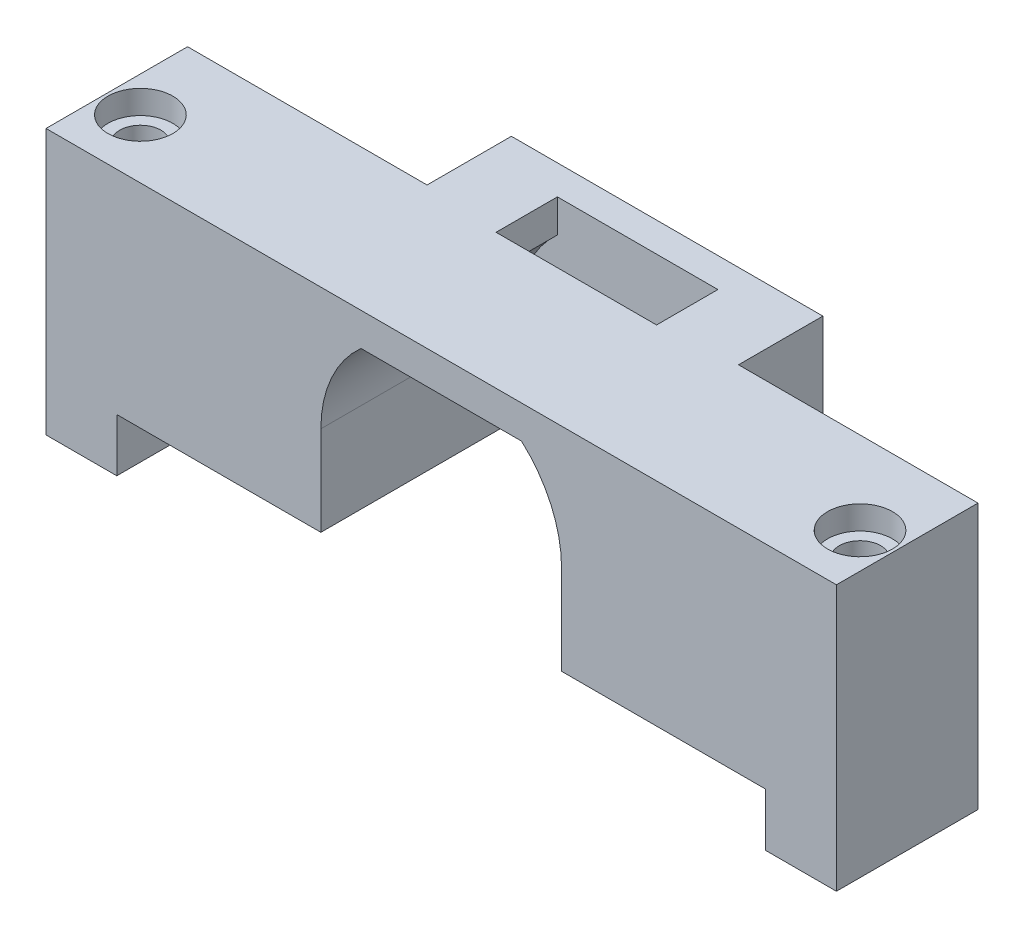
ISO-10303-21;
HEADER;
FILE_DESCRIPTION(('STEP AP214'),'2;1');
FILE_NAME('part.step','',(''),(''),'','','');
FILE_SCHEMA(('AUTOMOTIVE_DESIGN { 1 0 10303 214 1 1 1 1 }'));
ENDSEC;
DATA;
#1=APPLICATION_CONTEXT('core data for automotive mechanical design processes');
#2=APPLICATION_PROTOCOL_DEFINITION('international standard','automotive_design',2000,#1);
#3=PRODUCT_CONTEXT('',#1,'mechanical');
#4=PRODUCT('Part','Part','',(#3));
#5=PRODUCT_RELATED_PRODUCT_CATEGORY('part','',(#4));
#6=PRODUCT_DEFINITION_FORMATION('','',#4);
#7=PRODUCT_DEFINITION_CONTEXT('part definition',#1,'design');
#8=PRODUCT_DEFINITION('design','',#6,#7);
#9=PRODUCT_DEFINITION_SHAPE('','',#8);
#10=(LENGTH_UNIT() NAMED_UNIT(*) SI_UNIT(.MILLI.,.METRE.));
#11=(NAMED_UNIT(*) PLANE_ANGLE_UNIT() SI_UNIT($,.RADIAN.));
#12=(NAMED_UNIT(*) SI_UNIT($,.STERADIAN.) SOLID_ANGLE_UNIT());
#13=UNCERTAINTY_MEASURE_WITH_UNIT(LENGTH_MEASURE(1.E-05),#10,'distance_accuracy_value','');
#14=(GEOMETRIC_REPRESENTATION_CONTEXT(3) GLOBAL_UNCERTAINTY_ASSIGNED_CONTEXT((#13)) GLOBAL_UNIT_ASSIGNED_CONTEXT((#10,
#11,#12)) REPRESENTATION_CONTEXT('',''));
#15=CARTESIAN_POINT('',(0.,0.,0.));
#16=DIRECTION('',(0.,0.,1.));
#17=DIRECTION('',(1.,0.,0.));
#18=AXIS2_PLACEMENT_3D('',#15,#16,#17);
#19=CARTESIAN_POINT('',(0.,18.,12.));
#20=DIRECTION('',(0.,1.,0.));
#21=DIRECTION('',(0.,0.,1.));
#22=AXIS2_PLACEMENT_3D('',#19,#20,#21);
#23=PLANE('',#22);
#24=CARTESIAN_POINT('',(-3.,18.,7.));
#25=DIRECTION('',(0.,1.,0.));
#26=DIRECTION('',(0.,0.,1.));
#27=AXIS2_PLACEMENT_3D('',#24,#25,#26);
#28=CIRCLE('',#27,2.75);
#29=CARTESIAN_POINT('',(-3.,18.,9.75));
#30=VERTEX_POINT('',#29);
#31=EDGE_CURVE('E293',#30,#30,#28,.T.);
#32=ORIENTED_EDGE('',*,*,#31,.F.);
#33=EDGE_LOOP('',(#32));
#34=FACE_BOUND('',#33,.T.);
#35=CARTESIAN_POINT('',(58.,18.,6.99999999999999));
#36=DIRECTION('',(0.,1.,0.));
#37=DIRECTION('',(0.,0.,1.));
#38=AXIS2_PLACEMENT_3D('',#35,#36,#37);
#39=CIRCLE('',#38,2.75);
#40=CARTESIAN_POINT('',(58.,18.,9.74999999999999));
#41=VERTEX_POINT('',#40);
#42=EDGE_CURVE('E287',#41,#41,#39,.T.);
#43=ORIENTED_EDGE('',*,*,#42,.F.);
#44=EDGE_LOOP('',(#43));
#45=FACE_BOUND('',#44,.T.);
#46=DIRECTION('',(1.,0.,0.));
#47=VECTOR('',#46,1.);
#48=CARTESIAN_POINT('',(0.,18.,0.));
#49=LINE('',#48,#47);
#50=CARTESIAN_POINT('',(-6.,18.,0.));
#51=VERTEX_POINT('',#50);
#52=CARTESIAN_POINT('',(14.3,18.,0.));
#53=VERTEX_POINT('',#52);
#54=EDGE_CURVE('E479',#51,#53,#49,.T.);
#55=ORIENTED_EDGE('',*,*,#54,.F.);
#56=DIRECTION('',(0.,0.,-1.));
#57=VECTOR('',#56,1.);
#58=CARTESIAN_POINT('',(-6.,18.,0.));
#59=LINE('',#58,#57);
#60=CARTESIAN_POINT('',(-6.,18.,12.));
#61=VERTEX_POINT('',#60);
#62=EDGE_CURVE('E427',#61,#51,#59,.T.);
#63=ORIENTED_EDGE('',*,*,#62,.F.);
#64=DIRECTION('',(1.,0.,0.));
#65=VECTOR('',#64,1.);
#66=CARTESIAN_POINT('',(0.,18.,12.));
#67=LINE('',#66,#65);
#68=CARTESIAN_POINT('',(61.,18.,12.));
#69=VERTEX_POINT('',#68);
#70=EDGE_CURVE('E466',#61,#69,#67,.T.);
#71=ORIENTED_EDGE('',*,*,#70,.T.);
#72=DIRECTION('',(0.,0.,1.));
#73=VECTOR('',#72,1.);
#74=CARTESIAN_POINT('',(61.,18.,12.));
#75=LINE('',#74,#73);
#76=CARTESIAN_POINT('',(61.,18.,0.));
#77=VERTEX_POINT('',#76);
#78=EDGE_CURVE('E394',#77,#69,#75,.T.);
#79=ORIENTED_EDGE('',*,*,#78,.F.);
#80=CARTESIAN_POINT('',(40.7,18.,0.));
#81=VERTEX_POINT('',#80);
#82=EDGE_CURVE('E478',#81,#77,#49,.T.);
#83=ORIENTED_EDGE('',*,*,#82,.F.);
#84=DIRECTION('',(0.,0.,1.));
#85=VECTOR('',#84,1.);
#86=CARTESIAN_POINT('',(40.7,18.,-4.65));
#87=LINE('',#86,#85);
#88=CARTESIAN_POINT('',(40.7,18.,-7.15));
#89=VERTEX_POINT('',#88);
#90=EDGE_CURVE('E365',#89,#81,#87,.T.);
#91=ORIENTED_EDGE('',*,*,#90,.F.);
#92=DIRECTION('',(1.,0.,0.));
#93=VECTOR('',#92,1.);
#94=CARTESIAN_POINT('',(14.3,18.,-7.15));
#95=LINE('',#94,#93);
#96=CARTESIAN_POINT('',(14.3,18.,-7.15));
#97=VERTEX_POINT('',#96);
#98=EDGE_CURVE('E314',#97,#89,#95,.T.);
#99=ORIENTED_EDGE('',*,*,#98,.F.);
#100=DIRECTION('',(0.,0.,1.));
#101=VECTOR('',#100,1.);
#102=CARTESIAN_POINT('',(14.3,18.,-4.65));
#103=LINE('',#102,#101);
#104=EDGE_CURVE('E369',#97,#53,#103,.T.);
#105=ORIENTED_EDGE('',*,*,#104,.T.);
#106=EDGE_LOOP('',(#55,#63,#71,#79,#83,#91,#99,#105));
#107=FACE_BOUND('',#106,.T.);
#108=DIRECTION('',(0.,0.,-1.));
#109=VECTOR('',#108,1.);
#110=CARTESIAN_POINT('',(20.697059459322,18.,0.549999999999999));
#111=LINE('',#110,#109);
#112=CARTESIAN_POINT('',(20.697059459322,18.,0.549999999999999));
#113=VERTEX_POINT('',#112);
#114=CARTESIAN_POINT('',(20.697059459322,18.,-4.65));
#115=VERTEX_POINT('',#114);
#116=EDGE_CURVE('E219',#113,#115,#111,.T.);
#117=ORIENTED_EDGE('',*,*,#116,.T.);
#118=DIRECTION('',(-1.,0.,0.));
#119=VECTOR('',#118,1.);
#120=CARTESIAN_POINT('',(34.302940540678,18.,-4.65));
#121=LINE('',#120,#119);
#122=CARTESIAN_POINT('',(34.302940540678,18.,-4.65));
#123=VERTEX_POINT('',#122);
#124=EDGE_CURVE('E228',#123,#115,#121,.T.);
#125=ORIENTED_EDGE('',*,*,#124,.F.);
#126=DIRECTION('',(0.,0.,-1.));
#127=VECTOR('',#126,1.);
#128=CARTESIAN_POINT('',(34.302940540678,18.,0.549999999999999));
#129=LINE('',#128,#127);
#130=CARTESIAN_POINT('',(34.302940540678,18.,0.55));
#131=VERTEX_POINT('',#130);
#132=EDGE_CURVE('E238',#131,#123,#129,.T.);
#133=ORIENTED_EDGE('',*,*,#132,.F.);
#134=DIRECTION('',(-1.,0.,0.));
#135=VECTOR('',#134,1.);
#136=CARTESIAN_POINT('',(34.302940540678,18.,0.549999999999999));
#137=LINE('',#136,#135);
#138=EDGE_CURVE('E57',#131,#113,#137,.T.);
#139=ORIENTED_EDGE('',*,*,#138,.T.);
#140=EDGE_LOOP('',(#117,#125,#133,#139));
#141=FACE_BOUND('',#140,.T.);
#142=ADVANCED_FACE('F41',(#34,#45,#107,#141),#23,.T.);
#143=CARTESIAN_POINT('',(0.,0.,12.));
#144=DIRECTION('',(0.,1.,0.));
#145=DIRECTION('',(0.,0.,1.));
#146=AXIS2_PLACEMENT_3D('',#143,#144,#145);
#147=PLANE('',#146);
#148=DIRECTION('',(-1.,0.,0.));
#149=VECTOR('',#148,1.);
#150=CARTESIAN_POINT('',(40.7,0.,-7.15));
#151=LINE('',#150,#149);
#152=CARTESIAN_POINT('',(22.5946434398761,0.,-7.15));
#153=VERTEX_POINT('',#152);
#154=CARTESIAN_POINT('',(14.3,0.,-7.15));
#155=VERTEX_POINT('',#154);
#156=EDGE_CURVE('E323',#153,#155,#151,.T.);
#157=ORIENTED_EDGE('',*,*,#156,.F.);
#158=DIRECTION('',(0.,0.,-1.));
#159=VECTOR('',#158,1.);
#160=CARTESIAN_POINT('',(22.5946434398761,0.,7.47494488658952));
#161=LINE('',#160,#159);
#162=CARTESIAN_POINT('',(22.5946434398761,0.,-4.65));
#163=VERTEX_POINT('',#162);
#164=EDGE_CURVE('E260',#163,#153,#161,.T.);
#165=ORIENTED_EDGE('',*,*,#164,.F.);
#166=DIRECTION('',(-1.,0.,0.));
#167=VECTOR('',#166,1.);
#168=CARTESIAN_POINT('',(40.7,0.,-4.65));
#169=LINE('',#168,#167);
#170=CARTESIAN_POINT('',(17.3,0.,-4.65));
#171=VERTEX_POINT('',#170);
#172=EDGE_CURVE('E308',#163,#171,#169,.T.);
#173=ORIENTED_EDGE('',*,*,#172,.T.);
#174=DIRECTION('',(0.,0.,-1.));
#175=VECTOR('',#174,1.);
#176=CARTESIAN_POINT('',(17.3,0.,12.));
#177=LINE('',#176,#175);
#178=CARTESIAN_POINT('',(17.3,0.,12.));
#179=VERTEX_POINT('',#178);
#180=EDGE_CURVE('E487',#179,#171,#177,.T.);
#181=ORIENTED_EDGE('',*,*,#180,.F.);
#182=DIRECTION('',(1.,0.,0.));
#183=VECTOR('',#182,1.);
#184=CARTESIAN_POINT('',(0.,0.,12.));
#185=LINE('',#184,#183);
#186=CARTESIAN_POINT('',(0.,0.,12.));
#187=VERTEX_POINT('',#186);
#188=EDGE_CURVE('E469',#187,#179,#185,.T.);
#189=ORIENTED_EDGE('',*,*,#188,.F.);
#190=DIRECTION('',(0.,0.,-1.));
#191=VECTOR('',#190,1.);
#192=CARTESIAN_POINT('',(0.,0.,12.));
#193=LINE('',#192,#191);
#194=CARTESIAN_POINT('',(0.,0.,0.));
#195=VERTEX_POINT('',#194);
#196=EDGE_CURVE('E491',#187,#195,#193,.T.);
#197=ORIENTED_EDGE('',*,*,#196,.T.);
#198=DIRECTION('',(1.,0.,0.));
#199=VECTOR('',#198,1.);
#200=CARTESIAN_POINT('',(0.,0.,0.));
#201=LINE('',#200,#199);
#202=CARTESIAN_POINT('',(14.3,0.,0.));
#203=VERTEX_POINT('',#202);
#204=EDGE_CURVE('E453',#195,#203,#201,.T.);
#205=ORIENTED_EDGE('',*,*,#204,.T.);
#206=DIRECTION('',(0.,0.,1.));
#207=VECTOR('',#206,1.);
#208=CARTESIAN_POINT('',(14.3,0.,-4.65));
#209=LINE('',#208,#207);
#210=EDGE_CURVE('E351',#155,#203,#209,.T.);
#211=ORIENTED_EDGE('',*,*,#210,.F.);
#212=EDGE_LOOP('',(#157,#165,#173,#181,#189,#197,#205,#211));
#213=FACE_BOUND('',#212,.T.);
#214=ADVANCED_FACE('F523',(#213),#147,.F.);
#215=CARTESIAN_POINT('',(58.,-9.44974746830584,6.99999999999999));
#216=DIRECTION('',(0.,1.,0.));
#217=DIRECTION('',(0.,0.,1.));
#218=AXIS2_PLACEMENT_3D('',#215,#216,#217);
#219=CYLINDRICAL_SURFACE('',#218,1.75);
#220=CARTESIAN_POINT('',(58.,-4.5,6.99999999999999));
#221=DIRECTION('',(0.,1.,0.));
#222=DIRECTION('',(0.,0.,1.));
#223=AXIS2_PLACEMENT_3D('',#220,#221,#222);
#224=CIRCLE('',#223,1.75);
#225=CARTESIAN_POINT('',(58.,-4.5,8.75));
#226=VERTEX_POINT('',#225);
#227=EDGE_CURVE('E373',#226,#226,#224,.F.);
#228=ORIENTED_EDGE('',*,*,#227,.T.);
#229=EDGE_LOOP('',(#228));
#230=FACE_BOUND('',#229,.T.);
#231=CARTESIAN_POINT('',(58.,16.,6.99999999999999));
#232=DIRECTION('',(0.,1.,0.));
#233=DIRECTION('',(0.,0.,1.));
#234=AXIS2_PLACEMENT_3D('',#231,#232,#233);
#235=CIRCLE('',#234,1.75);
#236=CARTESIAN_POINT('',(58.,16.,8.75));
#237=VERTEX_POINT('',#236);
#238=EDGE_CURVE('E313',#237,#237,#235,.F.);
#239=ORIENTED_EDGE('',*,*,#238,.F.);
#240=EDGE_LOOP('',(#239));
#241=FACE_BOUND('',#240,.T.);
#242=ADVANCED_FACE('F520',(#230,#241),#219,.F.);
#243=CARTESIAN_POINT('',(-3.,-9.44974746830584,7.));
#244=DIRECTION('',(0.,1.,0.));
#245=DIRECTION('',(0.,0.,1.));
#246=AXIS2_PLACEMENT_3D('',#243,#244,#245);
#247=CYLINDRICAL_SURFACE('',#246,1.75);
#248=CARTESIAN_POINT('',(-3.,-4.5,7.));
#249=DIRECTION('',(0.,1.,0.));
#250=DIRECTION('',(0.,0.,1.));
#251=AXIS2_PLACEMENT_3D('',#248,#249,#250);
#252=CIRCLE('',#251,1.75);
#253=CARTESIAN_POINT('',(-3.,-4.5,8.75));
#254=VERTEX_POINT('',#253);
#255=EDGE_CURVE('E374',#254,#254,#252,.F.);
#256=ORIENTED_EDGE('',*,*,#255,.T.);
#257=EDGE_LOOP('',(#256));
#258=FACE_BOUND('',#257,.T.);
#259=CARTESIAN_POINT('',(-3.,16.,7.));
#260=DIRECTION('',(0.,1.,0.));
#261=DIRECTION('',(0.,0.,1.));
#262=AXIS2_PLACEMENT_3D('',#259,#260,#261);
#263=CIRCLE('',#262,1.75);
#264=CARTESIAN_POINT('',(-3.,16.,8.75));
#265=VERTEX_POINT('',#264);
#266=EDGE_CURVE('E292',#265,#265,#263,.F.);
#267=ORIENTED_EDGE('',*,*,#266,.F.);
#268=EDGE_LOOP('',(#267));
#269=FACE_BOUND('',#268,.T.);
#270=ADVANCED_FACE('F522',(#258,#269),#247,.F.);
#271=CARTESIAN_POINT('',(0.,0.,0.));
#272=DIRECTION('',(0.,0.,1.));
#273=DIRECTION('',(1.,0.,0.));
#274=AXIS2_PLACEMENT_3D('',#271,#272,#273);
#275=PLANE('',#274);
#276=DIRECTION('',(0.,1.,0.));
#277=VECTOR('',#276,1.);
#278=CARTESIAN_POINT('',(14.3,0.,0.));
#279=LINE('',#278,#277);
#280=EDGE_CURVE('E332',#203,#53,#279,.T.);
#281=ORIENTED_EDGE('',*,*,#280,.F.);
#282=ORIENTED_EDGE('',*,*,#204,.F.);
#283=DIRECTION('',(0.,-1.,0.));
#284=VECTOR('',#283,1.);
#285=CARTESIAN_POINT('',(0.,18.,0.));
#286=LINE('',#285,#284);
#287=CARTESIAN_POINT('',(0.,-4.5,0.));
#288=VERTEX_POINT('',#287);
#289=EDGE_CURVE('E414',#195,#288,#286,.T.);
#290=ORIENTED_EDGE('',*,*,#289,.T.);
#291=DIRECTION('',(1.,0.,0.));
#292=VECTOR('',#291,1.);
#293=CARTESIAN_POINT('',(-6.,-4.5,0.));
#294=LINE('',#293,#292);
#295=CARTESIAN_POINT('',(-6.,-4.5,0.));
#296=VERTEX_POINT('',#295);
#297=EDGE_CURVE('E443',#296,#288,#294,.T.);
#298=ORIENTED_EDGE('',*,*,#297,.F.);
#299=DIRECTION('',(0.,-1.,0.));
#300=VECTOR('',#299,1.);
#301=CARTESIAN_POINT('',(-6.,18.,0.));
#302=LINE('',#301,#300);
#303=EDGE_CURVE('E415',#51,#296,#302,.T.);
#304=ORIENTED_EDGE('',*,*,#303,.F.);
#305=ORIENTED_EDGE('',*,*,#54,.T.);
#306=EDGE_LOOP('',(#281,#282,#290,#298,#304,#305));
#307=FACE_BOUND('',#306,.T.);
#308=ADVANCED_FACE('F530',(#307),#275,.F.);
#309=DIRECTION('',(0.,-1.,0.));
#310=VECTOR('',#309,1.);
#311=CARTESIAN_POINT('',(40.7,0.,0.));
#312=LINE('',#311,#310);
#313=CARTESIAN_POINT('',(40.7,0.,0.));
#314=VERTEX_POINT('',#313);
#315=EDGE_CURVE('E341',#81,#314,#312,.T.);
#316=ORIENTED_EDGE('',*,*,#315,.F.);
#317=ORIENTED_EDGE('',*,*,#82,.T.);
#318=DIRECTION('',(0.,1.,0.));
#319=VECTOR('',#318,1.);
#320=CARTESIAN_POINT('',(61.,18.,0.));
#321=LINE('',#320,#319);
#322=CARTESIAN_POINT('',(61.,-4.5,0.));
#323=VERTEX_POINT('',#322);
#324=EDGE_CURVE('E390',#323,#77,#321,.T.);
#325=ORIENTED_EDGE('',*,*,#324,.F.);
#326=DIRECTION('',(-1.,0.,0.));
#327=VECTOR('',#326,1.);
#328=CARTESIAN_POINT('',(61.,-4.5,0.));
#329=LINE('',#328,#327);
#330=CARTESIAN_POINT('',(55.,-4.5,0.));
#331=VERTEX_POINT('',#330);
#332=EDGE_CURVE('E398',#323,#331,#329,.T.);
#333=ORIENTED_EDGE('',*,*,#332,.T.);
#334=DIRECTION('',(0.,1.,0.));
#335=VECTOR('',#334,1.);
#336=CARTESIAN_POINT('',(55.,18.,0.));
#337=LINE('',#336,#335);
#338=CARTESIAN_POINT('',(55.,0.,0.));
#339=VERTEX_POINT('',#338);
#340=EDGE_CURVE('E387',#331,#339,#337,.T.);
#341=ORIENTED_EDGE('',*,*,#340,.T.);
#342=DIRECTION('',(1.,0.,0.));
#343=VECTOR('',#342,1.);
#344=CARTESIAN_POINT('',(0.,0.,0.));
#345=LINE('',#344,#343);
#346=EDGE_CURVE('E447',#314,#339,#345,.T.);
#347=ORIENTED_EDGE('',*,*,#346,.F.);
#348=EDGE_LOOP('',(#316,#317,#325,#333,#341,#347));
#349=FACE_BOUND('',#348,.T.);
#350=ADVANCED_FACE('F559',(#349),#275,.F.);
#351=CARTESIAN_POINT('',(27.5,7.6,12.));
#352=DIRECTION('',(0.,0.,-1.));
#353=DIRECTION('',(-1.,0.,0.));
#354=AXIS2_PLACEMENT_3D('',#351,#352,#353);
#355=CYLINDRICAL_SURFACE('',#354,10.2);
#356=DIRECTION('',(0.,0.,-1.));
#357=VECTOR('',#356,1.);
#358=CARTESIAN_POINT('',(17.3,7.6,12.));
#359=LINE('',#358,#357);
#360=CARTESIAN_POINT('',(17.3,7.6,12.));
#361=VERTEX_POINT('',#360);
#362=CARTESIAN_POINT('',(17.3,7.6,-4.65));
#363=VERTEX_POINT('',#362);
#364=EDGE_CURVE('E475',#361,#363,#359,.T.);
#365=ORIENTED_EDGE('',*,*,#364,.T.);
#366=CARTESIAN_POINT('',(27.5,7.6,-4.65));
#367=DIRECTION('',(0.,0.,1.));
#368=DIRECTION('',(1.,0.,0.));
#369=AXIS2_PLACEMENT_3D('',#366,#367,#368);
#370=CIRCLE('',#369,10.2);
#371=CARTESIAN_POINT('',(20.697059459322,15.2,-4.65));
#372=VERTEX_POINT('',#371);
#373=EDGE_CURVE('E344',#372,#363,#370,.T.);
#374=ORIENTED_EDGE('',*,*,#373,.F.);
#375=DIRECTION('',(0.,0.,-1.));
#376=VECTOR('',#375,1.);
#377=CARTESIAN_POINT('',(20.697059459322,15.2,0.549999999999999));
#378=LINE('',#377,#376);
#379=CARTESIAN_POINT('',(20.697059459322,15.2,0.549999999999999));
#380=VERTEX_POINT('',#379);
#381=EDGE_CURVE('E221',#380,#372,#378,.T.);
#382=ORIENTED_EDGE('',*,*,#381,.F.);
#383=DIRECTION('',(0.,0.,-1.));
#384=VECTOR('',#383,1.);
#385=CARTESIAN_POINT('',(20.697059459322,15.2,12.));
#386=LINE('',#385,#384);
#387=CARTESIAN_POINT('',(20.697059459322,15.2,12.));
#388=VERTEX_POINT('',#387);
#389=EDGE_CURVE('E50',#388,#380,#386,.T.);
#390=ORIENTED_EDGE('',*,*,#389,.F.);
#391=CARTESIAN_POINT('',(27.5,7.6,12.));
#392=DIRECTION('',(0.,0.,1.));
#393=DIRECTION('',(1.,0.,0.));
#394=AXIS2_PLACEMENT_3D('',#391,#392,#393);
#395=CIRCLE('',#394,10.2);
#396=EDGE_CURVE('E448',#388,#361,#395,.T.);
#397=ORIENTED_EDGE('',*,*,#396,.T.);
#398=EDGE_LOOP('',(#365,#374,#382,#390,#397));
#399=FACE_BOUND('',#398,.T.);
#400=ADVANCED_FACE('F43',(#399),#355,.F.);
#401=CARTESIAN_POINT('',(0.,15.2,12.));
#402=DIRECTION('',(0.,1.,0.));
#403=DIRECTION('',(0.,0.,1.));
#404=AXIS2_PLACEMENT_3D('',#401,#402,#403);
#405=PLANE('',#404);
#406=ORIENTED_EDGE('',*,*,#389,.T.);
#407=DIRECTION('',(-1.,0.,0.));
#408=VECTOR('',#407,1.);
#409=CARTESIAN_POINT('',(34.302940540678,15.2,0.549999999999999));
#410=LINE('',#409,#408);
#411=CARTESIAN_POINT('',(34.302940540678,15.2,0.549999999999999));
#412=VERTEX_POINT('',#411);
#413=EDGE_CURVE('E565',#412,#380,#410,.T.);
#414=ORIENTED_EDGE('',*,*,#413,.F.);
#415=DIRECTION('',(0.,0.,-1.));
#416=VECTOR('',#415,1.);
#417=CARTESIAN_POINT('',(34.302940540678,15.2,12.));
#418=LINE('',#417,#416);
#419=CARTESIAN_POINT('',(34.302940540678,15.2,12.));
#420=VERTEX_POINT('',#419);
#421=EDGE_CURVE('E505',#420,#412,#418,.T.);
#422=ORIENTED_EDGE('',*,*,#421,.F.);
#423=DIRECTION('',(1.,0.,0.));
#424=VECTOR('',#423,1.);
#425=CARTESIAN_POINT('',(0.,15.2,12.));
#426=LINE('',#425,#424);
#427=EDGE_CURVE('E452',#388,#420,#426,.T.);
#428=ORIENTED_EDGE('',*,*,#427,.F.);
#429=EDGE_LOOP('',(#406,#414,#422,#428));
#430=FACE_BOUND('',#429,.T.);
#431=ADVANCED_FACE('F552',(#430),#405,.F.);
#432=CARTESIAN_POINT('',(27.5,7.6,12.));
#433=DIRECTION('',(0.,0.,-1.));
#434=DIRECTION('',(-1.,0.,0.));
#435=AXIS2_PLACEMENT_3D('',#432,#433,#434);
#436=CYLINDRICAL_SURFACE('',#435,10.2);
#437=CARTESIAN_POINT('',(27.5,7.6,-4.65));
#438=DIRECTION('',(0.,0.,1.));
#439=DIRECTION('',(-1.,0.,0.));
#440=AXIS2_PLACEMENT_3D('',#437,#438,#439);
#441=CIRCLE('',#440,10.2);
#442=CARTESIAN_POINT('',(37.7,7.6,-4.65));
#443=VERTEX_POINT('',#442);
#444=CARTESIAN_POINT('',(34.302940540678,15.2,-4.65));
#445=VERTEX_POINT('',#444);
#446=EDGE_CURVE('E340',#443,#445,#441,.T.);
#447=ORIENTED_EDGE('',*,*,#446,.F.);
#448=DIRECTION('',(0.,0.,-1.));
#449=VECTOR('',#448,1.);
#450=CARTESIAN_POINT('',(37.7,7.6,12.));
#451=LINE('',#450,#449);
#452=CARTESIAN_POINT('',(37.7,7.6,12.));
#453=VERTEX_POINT('',#452);
#454=EDGE_CURVE('E502',#453,#443,#451,.T.);
#455=ORIENTED_EDGE('',*,*,#454,.F.);
#456=CARTESIAN_POINT('',(27.5,7.6,12.));
#457=DIRECTION('',(0.,0.,1.));
#458=DIRECTION('',(1.,0.,0.));
#459=AXIS2_PLACEMENT_3D('',#456,#457,#458);
#460=CIRCLE('',#459,10.2);
#461=EDGE_CURVE('E456',#453,#420,#460,.T.);
#462=ORIENTED_EDGE('',*,*,#461,.T.);
#463=ORIENTED_EDGE('',*,*,#421,.T.);
#464=DIRECTION('',(0.,0.,-1.));
#465=VECTOR('',#464,1.);
#466=CARTESIAN_POINT('',(34.302940540678,15.2,0.549999999999999));
#467=LINE('',#466,#465);
#468=EDGE_CURVE('E254',#412,#445,#467,.T.);
#469=ORIENTED_EDGE('',*,*,#468,.T.);
#470=EDGE_LOOP('',(#447,#455,#462,#463,#469));
#471=FACE_BOUND('',#470,.T.);
#472=ADVANCED_FACE('F549',(#471),#436,.F.);
#473=CARTESIAN_POINT('',(37.7,0.,12.));
#474=DIRECTION('',(1.,0.,0.));
#475=DIRECTION('',(0.,0.,-1.));
#476=AXIS2_PLACEMENT_3D('',#473,#474,#475);
#477=PLANE('',#476);
#478=ORIENTED_EDGE('',*,*,#454,.T.);
#479=DIRECTION('',(0.,1.,0.));
#480=VECTOR('',#479,1.);
#481=CARTESIAN_POINT('',(37.7,6.,-4.65));
#482=LINE('',#481,#480);
#483=CARTESIAN_POINT('',(37.7,0.,-4.65));
#484=VERTEX_POINT('',#483);
#485=EDGE_CURVE('E336',#484,#443,#482,.T.);
#486=ORIENTED_EDGE('',*,*,#485,.F.);
#487=DIRECTION('',(0.,0.,-1.));
#488=VECTOR('',#487,1.);
#489=CARTESIAN_POINT('',(37.7,0.,12.));
#490=LINE('',#489,#488);
#491=CARTESIAN_POINT('',(37.7,0.,12.));
#492=VERTEX_POINT('',#491);
#493=EDGE_CURVE('E499',#492,#484,#490,.T.);
#494=ORIENTED_EDGE('',*,*,#493,.F.);
#495=DIRECTION('',(0.,-1.,0.));
#496=VECTOR('',#495,1.);
#497=CARTESIAN_POINT('',(37.7,0.,12.));
#498=LINE('',#497,#496);
#499=EDGE_CURVE('E460',#453,#492,#498,.T.);
#500=ORIENTED_EDGE('',*,*,#499,.F.);
#501=EDGE_LOOP('',(#478,#486,#494,#500));
#502=FACE_BOUND('',#501,.T.);
#503=ADVANCED_FACE('F546',(#502),#477,.F.);
#504=CARTESIAN_POINT('',(32.425,0.,-4.65));
#505=VERTEX_POINT('',#504);
#506=EDGE_CURVE('E319',#484,#505,#169,.T.);
#507=ORIENTED_EDGE('',*,*,#506,.T.);
#508=DIRECTION('',(0.,0.,-1.));
#509=VECTOR('',#508,1.);
#510=CARTESIAN_POINT('',(32.425,0.,7.47494488658952));
#511=LINE('',#510,#509);
#512=CARTESIAN_POINT('',(32.425,0.,-7.15));
#513=VERTEX_POINT('',#512);
#514=EDGE_CURVE('E274',#505,#513,#511,.T.);
#515=ORIENTED_EDGE('',*,*,#514,.T.);
#516=CARTESIAN_POINT('',(40.7,0.,-7.15));
#517=VERTEX_POINT('',#516);
#518=EDGE_CURVE('E324',#517,#513,#151,.T.);
#519=ORIENTED_EDGE('',*,*,#518,.F.);
#520=DIRECTION('',(0.,0.,1.));
#521=VECTOR('',#520,1.);
#522=CARTESIAN_POINT('',(40.7,0.,-4.65));
#523=LINE('',#522,#521);
#524=EDGE_CURVE('E361',#517,#314,#523,.T.);
#525=ORIENTED_EDGE('',*,*,#524,.T.);
#526=ORIENTED_EDGE('',*,*,#346,.T.);
#527=DIRECTION('',(0.,0.,-1.));
#528=VECTOR('',#527,1.);
#529=CARTESIAN_POINT('',(55.,0.,12.));
#530=LINE('',#529,#528);
#531=CARTESIAN_POINT('',(55.,0.,12.));
#532=VERTEX_POINT('',#531);
#533=EDGE_CURVE('E495',#532,#339,#530,.T.);
#534=ORIENTED_EDGE('',*,*,#533,.F.);
#535=DIRECTION('',(1.,0.,0.));
#536=VECTOR('',#535,1.);
#537=CARTESIAN_POINT('',(0.,0.,12.));
#538=LINE('',#537,#536);
#539=EDGE_CURVE('E463',#492,#532,#538,.T.);
#540=ORIENTED_EDGE('',*,*,#539,.F.);
#541=ORIENTED_EDGE('',*,*,#493,.T.);
#542=EDGE_LOOP('',(#507,#515,#519,#525,#526,#534,#540,#541));
#543=FACE_BOUND('',#542,.T.);
#544=ADVANCED_FACE('F535',(#543),#147,.F.);
#545=CARTESIAN_POINT('',(17.3,0.,12.));
#546=DIRECTION('',(-1.,0.,0.));
#547=DIRECTION('',(0.,-1.,0.));
#548=AXIS2_PLACEMENT_3D('',#545,#546,#547);
#549=PLANE('',#548);
#550=DIRECTION('',(0.,-1.,0.));
#551=VECTOR('',#550,1.);
#552=CARTESIAN_POINT('',(17.3,6.,-4.65));
#553=LINE('',#552,#551);
#554=EDGE_CURVE('E347',#363,#171,#553,.T.);
#555=ORIENTED_EDGE('',*,*,#554,.F.);
#556=ORIENTED_EDGE('',*,*,#364,.F.);
#557=DIRECTION('',(0.,1.,0.));
#558=VECTOR('',#557,1.);
#559=CARTESIAN_POINT('',(17.3,0.,12.));
#560=LINE('',#559,#558);
#561=EDGE_CURVE('E472',#179,#361,#560,.T.);
#562=ORIENTED_EDGE('',*,*,#561,.F.);
#563=ORIENTED_EDGE('',*,*,#180,.T.);
#564=EDGE_LOOP('',(#555,#556,#562,#563));
#565=FACE_BOUND('',#564,.T.);
#566=ADVANCED_FACE('F591',(#565),#549,.F.);
#567=CARTESIAN_POINT('',(0.,0.,12.));
#568=DIRECTION('',(0.,0.,1.));
#569=DIRECTION('',(1.,0.,0.));
#570=AXIS2_PLACEMENT_3D('',#567,#568,#569);
#571=PLANE('',#570);
#572=ORIENTED_EDGE('',*,*,#396,.F.);
#573=ORIENTED_EDGE('',*,*,#427,.T.);
#574=ORIENTED_EDGE('',*,*,#461,.F.);
#575=ORIENTED_EDGE('',*,*,#499,.T.);
#576=ORIENTED_EDGE('',*,*,#539,.T.);
#577=DIRECTION('',(0.,-1.,0.));
#578=VECTOR('',#577,1.);
#579=CARTESIAN_POINT('',(55.,18.,12.));
#580=LINE('',#579,#578);
#581=CARTESIAN_POINT('',(55.,-4.5,12.));
#582=VERTEX_POINT('',#581);
#583=EDGE_CURVE('E378',#532,#582,#580,.T.);
#584=ORIENTED_EDGE('',*,*,#583,.T.);
#585=DIRECTION('',(-1.,0.,0.));
#586=VECTOR('',#585,1.);
#587=CARTESIAN_POINT('',(61.,-4.5,12.));
#588=LINE('',#587,#586);
#589=CARTESIAN_POINT('',(61.,-4.5,12.));
#590=VERTEX_POINT('',#589);
#591=EDGE_CURVE('E410',#590,#582,#588,.T.);
#592=ORIENTED_EDGE('',*,*,#591,.F.);
#593=DIRECTION('',(0.,-1.,0.));
#594=VECTOR('',#593,1.);
#595=CARTESIAN_POINT('',(61.,18.,12.));
#596=LINE('',#595,#594);
#597=EDGE_CURVE('E382',#69,#590,#596,.T.);
#598=ORIENTED_EDGE('',*,*,#597,.F.);
#599=ORIENTED_EDGE('',*,*,#70,.F.);
#600=DIRECTION('',(0.,1.,0.));
#601=VECTOR('',#600,1.);
#602=CARTESIAN_POINT('',(-6.,18.,12.));
#603=LINE('',#602,#601);
#604=CARTESIAN_POINT('',(-6.,-4.5,12.));
#605=VERTEX_POINT('',#604);
#606=EDGE_CURVE('E423',#605,#61,#603,.T.);
#607=ORIENTED_EDGE('',*,*,#606,.F.);
#608=DIRECTION('',(1.,0.,0.));
#609=VECTOR('',#608,1.);
#610=CARTESIAN_POINT('',(-6.,-4.5,12.));
#611=LINE('',#610,#609);
#612=CARTESIAN_POINT('',(0.,-4.5,12.));
#613=VERTEX_POINT('',#612);
#614=EDGE_CURVE('E431',#605,#613,#611,.T.);
#615=ORIENTED_EDGE('',*,*,#614,.T.);
#616=DIRECTION('',(0.,1.,0.));
#617=VECTOR('',#616,1.);
#618=CARTESIAN_POINT('',(0.,18.,12.));
#619=LINE('',#618,#617);
#620=EDGE_CURVE('E420',#613,#187,#619,.T.);
#621=ORIENTED_EDGE('',*,*,#620,.T.);
#622=ORIENTED_EDGE('',*,*,#188,.T.);
#623=ORIENTED_EDGE('',*,*,#561,.T.);
#624=EDGE_LOOP('',(#572,#573,#574,#575,#576,#584,#592,#598,#599,#607,#615,#621,#622,#623));
#625=FACE_BOUND('',#624,.T.);
#626=ADVANCED_FACE('F584',(#625),#571,.T.);
#627=CARTESIAN_POINT('',(-6.,-4.5,0.));
#628=DIRECTION('',(0.,1.,0.));
#629=DIRECTION('',(0.,0.,1.));
#630=AXIS2_PLACEMENT_3D('',#627,#628,#629);
#631=PLANE('',#630);
#632=ORIENTED_EDGE('',*,*,#255,.F.);
#633=EDGE_LOOP('',(#632));
#634=FACE_BOUND('',#633,.T.);
#635=DIRECTION('',(0.,0.,1.));
#636=VECTOR('',#635,1.);
#637=CARTESIAN_POINT('',(0.,-4.5,0.));
#638=LINE('',#637,#636);
#639=EDGE_CURVE('E434',#288,#613,#638,.T.);
#640=ORIENTED_EDGE('',*,*,#639,.T.);
#641=ORIENTED_EDGE('',*,*,#614,.F.);
#642=DIRECTION('',(0.,0.,1.));
#643=VECTOR('',#642,1.);
#644=CARTESIAN_POINT('',(-6.,-4.5,0.));
#645=LINE('',#644,#643);
#646=EDGE_CURVE('E419',#296,#605,#645,.T.);
#647=ORIENTED_EDGE('',*,*,#646,.F.);
#648=ORIENTED_EDGE('',*,*,#297,.T.);
#649=EDGE_LOOP('',(#640,#641,#647,#648));
#650=FACE_BOUND('',#649,.T.);
#651=ADVANCED_FACE('F616',(#634,#650),#631,.F.);
#652=CARTESIAN_POINT('',(-6.,0.,0.));
#653=DIRECTION('',(-1.,0.,0.));
#654=DIRECTION('',(0.,0.,1.));
#655=AXIS2_PLACEMENT_3D('',#652,#653,#654);
#656=PLANE('',#655);
#657=ORIENTED_EDGE('',*,*,#303,.T.);
#658=ORIENTED_EDGE('',*,*,#646,.T.);
#659=ORIENTED_EDGE('',*,*,#606,.T.);
#660=ORIENTED_EDGE('',*,*,#62,.T.);
#661=EDGE_LOOP('',(#657,#658,#659,#660));
#662=FACE_BOUND('',#661,.T.);
#663=ADVANCED_FACE('F611',(#662),#656,.T.);
#664=CARTESIAN_POINT('',(0.,0.,0.));
#665=DIRECTION('',(-1.,0.,0.));
#666=DIRECTION('',(0.,0.,1.));
#667=AXIS2_PLACEMENT_3D('',#664,#665,#666);
#668=PLANE('',#667);
#669=ORIENTED_EDGE('',*,*,#196,.F.);
#670=ORIENTED_EDGE('',*,*,#620,.F.);
#671=ORIENTED_EDGE('',*,*,#639,.F.);
#672=ORIENTED_EDGE('',*,*,#289,.F.);
#673=EDGE_LOOP('',(#669,#670,#671,#672));
#674=FACE_BOUND('',#673,.T.);
#675=ADVANCED_FACE('F620',(#674),#668,.F.);
#676=CARTESIAN_POINT('',(55.,0.,0.));
#677=DIRECTION('',(1.,0.,0.));
#678=DIRECTION('',(0.,0.,-1.));
#679=AXIS2_PLACEMENT_3D('',#676,#677,#678);
#680=PLANE('',#679);
#681=ORIENTED_EDGE('',*,*,#583,.F.);
#682=ORIENTED_EDGE('',*,*,#533,.T.);
#683=ORIENTED_EDGE('',*,*,#340,.F.);
#684=DIRECTION('',(0.,0.,-1.));
#685=VECTOR('',#684,1.);
#686=CARTESIAN_POINT('',(55.,-4.5,12.));
#687=LINE('',#686,#685);
#688=EDGE_CURVE('E401',#582,#331,#687,.T.);
#689=ORIENTED_EDGE('',*,*,#688,.F.);
#690=EDGE_LOOP('',(#681,#682,#683,#689));
#691=FACE_BOUND('',#690,.T.);
#692=ADVANCED_FACE('F646',(#691),#680,.F.);
#693=CARTESIAN_POINT('',(61.,-4.5,12.));
#694=DIRECTION('',(0.,1.,0.));
#695=DIRECTION('',(0.,0.,1.));
#696=AXIS2_PLACEMENT_3D('',#693,#694,#695);
#697=PLANE('',#696);
#698=ORIENTED_EDGE('',*,*,#227,.F.);
#699=EDGE_LOOP('',(#698));
#700=FACE_BOUND('',#699,.T.);
#701=ORIENTED_EDGE('',*,*,#688,.T.);
#702=ORIENTED_EDGE('',*,*,#332,.F.);
#703=DIRECTION('',(0.,0.,-1.));
#704=VECTOR('',#703,1.);
#705=CARTESIAN_POINT('',(61.,-4.5,12.));
#706=LINE('',#705,#704);
#707=EDGE_CURVE('E386',#590,#323,#706,.T.);
#708=ORIENTED_EDGE('',*,*,#707,.F.);
#709=ORIENTED_EDGE('',*,*,#591,.T.);
#710=EDGE_LOOP('',(#701,#702,#708,#709));
#711=FACE_BOUND('',#710,.T.);
#712=ADVANCED_FACE('F648',(#700,#711),#697,.F.);
#713=CARTESIAN_POINT('',(61.,0.,0.));
#714=DIRECTION('',(1.,0.,0.));
#715=DIRECTION('',(0.,0.,-1.));
#716=AXIS2_PLACEMENT_3D('',#713,#714,#715);
#717=PLANE('',#716);
#718=ORIENTED_EDGE('',*,*,#597,.T.);
#719=ORIENTED_EDGE('',*,*,#707,.T.);
#720=ORIENTED_EDGE('',*,*,#324,.T.);
#721=ORIENTED_EDGE('',*,*,#78,.T.);
#722=EDGE_LOOP('',(#718,#719,#720,#721));
#723=FACE_BOUND('',#722,.T.);
#724=ADVANCED_FACE('F604',(#723),#717,.T.);
#725=CARTESIAN_POINT('',(14.3,0.,-4.65));
#726=DIRECTION('',(1.,0.,0.));
#727=DIRECTION('',(0.,0.,-1.));
#728=AXIS2_PLACEMENT_3D('',#725,#726,#727);
#729=PLANE('',#728);
#730=ORIENTED_EDGE('',*,*,#280,.T.);
#731=ORIENTED_EDGE('',*,*,#104,.F.);
#732=DIRECTION('',(0.,1.,0.));
#733=VECTOR('',#732,1.);
#734=CARTESIAN_POINT('',(14.3,0.,-7.15));
#735=LINE('',#734,#733);
#736=EDGE_CURVE('E328',#155,#97,#735,.T.);
#737=ORIENTED_EDGE('',*,*,#736,.F.);
#738=ORIENTED_EDGE('',*,*,#210,.T.);
#739=EDGE_LOOP('',(#730,#731,#737,#738));
#740=FACE_BOUND('',#739,.T.);
#741=ADVANCED_FACE('F626',(#740),#729,.F.);
#742=CARTESIAN_POINT('',(40.7,0.,-4.65));
#743=DIRECTION('',(-1.,0.,0.));
#744=DIRECTION('',(0.,0.,1.));
#745=AXIS2_PLACEMENT_3D('',#742,#743,#744);
#746=PLANE('',#745);
#747=ORIENTED_EDGE('',*,*,#315,.T.);
#748=ORIENTED_EDGE('',*,*,#524,.F.);
#749=DIRECTION('',(0.,-1.,0.));
#750=VECTOR('',#749,1.);
#751=CARTESIAN_POINT('',(40.7,18.,-7.15));
#752=LINE('',#751,#750);
#753=EDGE_CURVE('E318',#89,#517,#752,.T.);
#754=ORIENTED_EDGE('',*,*,#753,.F.);
#755=ORIENTED_EDGE('',*,*,#90,.T.);
#756=EDGE_LOOP('',(#747,#748,#754,#755));
#757=FACE_BOUND('',#756,.T.);
#758=ADVANCED_FACE('F650',(#757),#746,.F.);
#759=CARTESIAN_POINT('',(0.,0.,-4.65));
#760=DIRECTION('',(0.,0.,-1.));
#761=DIRECTION('',(-1.,0.,0.));
#762=AXIS2_PLACEMENT_3D('',#759,#760,#761);
#763=PLANE('',#762);
#764=ORIENTED_EDGE('',*,*,#172,.F.);
#765=DIRECTION('',(0.,-1.,0.));
#766=VECTOR('',#765,1.);
#767=CARTESIAN_POINT('',(22.5946434398761,7.09777277768608,-4.65));
#768=LINE('',#767,#766);
#769=CARTESIAN_POINT('',(22.5946434398761,7.09777277768608,-4.65));
#770=VERTEX_POINT('',#769);
#771=EDGE_CURVE('E259',#770,#163,#768,.T.);
#772=ORIENTED_EDGE('',*,*,#771,.F.);
#773=CARTESIAN_POINT('',(27.5,7.53720652473903,-4.65));
#774=DIRECTION('',(0.,0.,-1.));
#775=DIRECTION('',(-1.,0.,0.));
#776=AXIS2_PLACEMENT_3D('',#773,#774,#775);
#777=CIRCLE('',#776,4.925);
#778=CARTESIAN_POINT('',(32.4053565601239,7.09777277768608,-4.65));
#779=VERTEX_POINT('',#778);
#780=EDGE_CURVE('E309',#770,#779,#777,.T.);
#781=ORIENTED_EDGE('',*,*,#780,.T.);
#782=DIRECTION('',(-1.,0.,0.));
#783=VECTOR('',#782,1.);
#784=CARTESIAN_POINT('',(22.5946434398761,7.09777277768608,-4.65));
#785=LINE('',#784,#783);
#786=CARTESIAN_POINT('',(32.425,7.09777277768608,-4.65));
#787=VERTEX_POINT('',#786);
#788=EDGE_CURVE('E64',#787,#779,#785,.T.);
#789=ORIENTED_EDGE('',*,*,#788,.F.);
#790=DIRECTION('',(0.,1.,0.));
#791=VECTOR('',#790,1.);
#792=CARTESIAN_POINT('',(32.425,7.09777277768608,-4.65));
#793=LINE('',#792,#791);
#794=EDGE_CURVE('E256',#505,#787,#793,.T.);
#795=ORIENTED_EDGE('',*,*,#794,.F.);
#796=ORIENTED_EDGE('',*,*,#506,.F.);
#797=ORIENTED_EDGE('',*,*,#485,.T.);
#798=ORIENTED_EDGE('',*,*,#446,.T.);
#799=DIRECTION('',(0.,-1.,0.));
#800=VECTOR('',#799,1.);
#801=CARTESIAN_POINT('',(34.302940540678,32.5657131648265,-4.65));
#802=LINE('',#801,#800);
#803=EDGE_CURVE('E232',#123,#445,#802,.T.);
#804=ORIENTED_EDGE('',*,*,#803,.F.);
#805=ORIENTED_EDGE('',*,*,#124,.T.);
#806=DIRECTION('',(0.,-1.,0.));
#807=VECTOR('',#806,1.);
#808=CARTESIAN_POINT('',(20.697059459322,32.5657131648265,-4.65));
#809=LINE('',#808,#807);
#810=EDGE_CURVE('E215',#115,#372,#809,.T.);
#811=ORIENTED_EDGE('',*,*,#810,.T.);
#812=ORIENTED_EDGE('',*,*,#373,.T.);
#813=ORIENTED_EDGE('',*,*,#554,.T.);
#814=EDGE_LOOP('',(#764,#772,#781,#789,#795,#796,#797,#798,#804,#805,#811,#812,#813));
#815=FACE_BOUND('',#814,.T.);
#816=ADVANCED_FACE('F230',(#815),#763,.F.);
#817=CARTESIAN_POINT('',(0.,0.,-7.15));
#818=DIRECTION('',(0.,0.,-1.));
#819=DIRECTION('',(-1.,0.,0.));
#820=AXIS2_PLACEMENT_3D('',#817,#818,#819);
#821=PLANE('',#820);
#822=DIRECTION('',(0.,1.,0.));
#823=VECTOR('',#822,1.);
#824=CARTESIAN_POINT('',(22.5946434398761,7.09777277768608,-7.15));
#825=LINE('',#824,#823);
#826=CARTESIAN_POINT('',(22.5946434398761,7.09777277768608,-7.15));
#827=VERTEX_POINT('',#826);
#828=EDGE_CURVE('E237',#153,#827,#825,.T.);
#829=ORIENTED_EDGE('',*,*,#828,.F.);
#830=ORIENTED_EDGE('',*,*,#156,.T.);
#831=ORIENTED_EDGE('',*,*,#736,.T.);
#832=ORIENTED_EDGE('',*,*,#98,.T.);
#833=ORIENTED_EDGE('',*,*,#753,.T.);
#834=ORIENTED_EDGE('',*,*,#518,.T.);
#835=DIRECTION('',(0.,-1.,0.));
#836=VECTOR('',#835,1.);
#837=CARTESIAN_POINT('',(32.425,7.09777277768608,-7.15));
#838=LINE('',#837,#836);
#839=CARTESIAN_POINT('',(32.425,7.09777277768608,-7.15));
#840=VERTEX_POINT('',#839);
#841=EDGE_CURVE('E268',#840,#513,#838,.T.);
#842=ORIENTED_EDGE('',*,*,#841,.F.);
#843=DIRECTION('',(1.,0.,0.));
#844=VECTOR('',#843,1.);
#845=CARTESIAN_POINT('',(22.5946434398761,7.09777277768608,-7.15));
#846=LINE('',#845,#844);
#847=CARTESIAN_POINT('',(32.4053565601239,7.09777277768608,-7.15));
#848=VERTEX_POINT('',#847);
#849=EDGE_CURVE('E265',#848,#840,#846,.T.);
#850=ORIENTED_EDGE('',*,*,#849,.F.);
#851=CARTESIAN_POINT('',(27.5,7.53720652473903,-7.15));
#852=DIRECTION('',(0.,0.,-1.));
#853=DIRECTION('',(-1.,0.,0.));
#854=AXIS2_PLACEMENT_3D('',#851,#852,#853);
#855=CIRCLE('',#854,4.925);
#856=EDGE_CURVE('E304',#827,#848,#855,.T.);
#857=ORIENTED_EDGE('',*,*,#856,.F.);
#858=EDGE_LOOP('',(#829,#830,#831,#832,#833,#834,#842,#850,#857));
#859=FACE_BOUND('',#858,.T.);
#860=ADVANCED_FACE('F630',(#859),#821,.T.);
#861=CARTESIAN_POINT('',(27.5,7.53720652473903,-7.15));
#862=DIRECTION('',(0.,0.,1.));
#863=DIRECTION('',(1.,0.,0.));
#864=AXIS2_PLACEMENT_3D('',#861,#862,#863);
#865=CYLINDRICAL_SURFACE('',#864,4.925);
#866=DIRECTION('',(0.,0.,-1.));
#867=VECTOR('',#866,1.);
#868=CARTESIAN_POINT('',(22.5946434398761,7.09777277768608,7.47494488658952));
#869=LINE('',#868,#867);
#870=EDGE_CURVE('E271',#770,#827,#869,.T.);
#871=ORIENTED_EDGE('',*,*,#870,.T.);
#872=ORIENTED_EDGE('',*,*,#856,.T.);
#873=DIRECTION('',(0.,0.,1.));
#874=VECTOR('',#873,1.);
#875=CARTESIAN_POINT('',(32.4053565601239,7.09777277768608,-7.15));
#876=LINE('',#875,#874);
#877=EDGE_CURVE('E11',#779,#848,#876,.F.);
#878=ORIENTED_EDGE('',*,*,#877,.F.);
#879=ORIENTED_EDGE('',*,*,#780,.F.);
#880=EDGE_LOOP('',(#871,#872,#878,#879));
#881=FACE_BOUND('',#880,.T.);
#882=ADVANCED_FACE('F637',(#881),#865,.F.);
#883=CARTESIAN_POINT('',(-3.,16.,7.));
#884=DIRECTION('',(0.,1.,0.));
#885=DIRECTION('',(0.,0.,1.));
#886=AXIS2_PLACEMENT_3D('',#883,#884,#885);
#887=PLANE('',#886);
#888=CARTESIAN_POINT('',(-3.,16.,7.));
#889=DIRECTION('',(0.,1.,0.));
#890=DIRECTION('',(0.,0.,1.));
#891=AXIS2_PLACEMENT_3D('',#888,#889,#890);
#892=CIRCLE('',#891,2.75);
#893=CARTESIAN_POINT('',(-3.,16.,9.75));
#894=VERTEX_POINT('',#893);
#895=EDGE_CURVE('E288',#894,#894,#892,.T.);
#896=ORIENTED_EDGE('',*,*,#895,.T.);
#897=EDGE_LOOP('',(#896));
#898=FACE_BOUND('',#897,.T.);
#899=ORIENTED_EDGE('',*,*,#266,.T.);
#900=EDGE_LOOP('',(#899));
#901=FACE_BOUND('',#900,.T.);
#902=ADVANCED_FACE('F669',(#898,#901),#887,.T.);
#903=CARTESIAN_POINT('',(-3.,16.,7.));
#904=DIRECTION('',(0.,1.,0.));
#905=DIRECTION('',(0.,0.,1.));
#906=AXIS2_PLACEMENT_3D('',#903,#904,#905);
#907=CYLINDRICAL_SURFACE('',#906,2.75);
#908=ORIENTED_EDGE('',*,*,#895,.F.);
#909=EDGE_LOOP('',(#908));
#910=FACE_BOUND('',#909,.T.);
#911=ORIENTED_EDGE('',*,*,#31,.T.);
#912=EDGE_LOOP('',(#911));
#913=FACE_BOUND('',#912,.T.);
#914=ADVANCED_FACE('F672',(#910,#913),#907,.F.);
#915=CARTESIAN_POINT('',(58.,16.,6.99999999999999));
#916=DIRECTION('',(0.,1.,0.));
#917=DIRECTION('',(0.,0.,1.));
#918=AXIS2_PLACEMENT_3D('',#915,#916,#917);
#919=PLANE('',#918);
#920=CARTESIAN_POINT('',(58.,16.,6.99999999999999));
#921=DIRECTION('',(0.,1.,0.));
#922=DIRECTION('',(0.,0.,1.));
#923=AXIS2_PLACEMENT_3D('',#920,#921,#922);
#924=CIRCLE('',#923,2.75);
#925=CARTESIAN_POINT('',(58.,16.,9.74999999999999));
#926=VERTEX_POINT('',#925);
#927=EDGE_CURVE('E297',#926,#926,#924,.T.);
#928=ORIENTED_EDGE('',*,*,#927,.T.);
#929=EDGE_LOOP('',(#928));
#930=FACE_BOUND('',#929,.T.);
#931=ORIENTED_EDGE('',*,*,#238,.T.);
#932=EDGE_LOOP('',(#931));
#933=FACE_BOUND('',#932,.T.);
#934=ADVANCED_FACE('F518',(#930,#933),#919,.T.);
#935=CARTESIAN_POINT('',(58.,16.,6.99999999999999));
#936=DIRECTION('',(0.,1.,0.));
#937=DIRECTION('',(0.,0.,1.));
#938=AXIS2_PLACEMENT_3D('',#935,#936,#937);
#939=CYLINDRICAL_SURFACE('',#938,2.75);
#940=ORIENTED_EDGE('',*,*,#927,.F.);
#941=EDGE_LOOP('',(#940));
#942=FACE_BOUND('',#941,.T.);
#943=ORIENTED_EDGE('',*,*,#42,.T.);
#944=EDGE_LOOP('',(#943));
#945=FACE_BOUND('',#944,.T.);
#946=ADVANCED_FACE('F656',(#942,#945),#939,.F.);
#947=CARTESIAN_POINT('',(22.5946434398761,7.09777277768608,7.47494488658952));
#948=DIRECTION('',(0.,1.,0.));
#949=DIRECTION('',(0.,0.,1.));
#950=AXIS2_PLACEMENT_3D('',#947,#948,#949);
#951=PLANE('',#950);
#952=ORIENTED_EDGE('',*,*,#877,.T.);
#953=ORIENTED_EDGE('',*,*,#849,.T.);
#954=DIRECTION('',(0.,0.,-1.));
#955=VECTOR('',#954,1.);
#956=CARTESIAN_POINT('',(32.425,7.09777277768608,7.47494488658952));
#957=LINE('',#956,#955);
#958=EDGE_CURVE('E278',#787,#840,#957,.T.);
#959=ORIENTED_EDGE('',*,*,#958,.F.);
#960=ORIENTED_EDGE('',*,*,#788,.T.);
#961=EDGE_LOOP('',(#952,#953,#959,#960));
#962=FACE_BOUND('',#961,.T.);
#963=ADVANCED_FACE('F654',(#962),#951,.F.);
#964=CARTESIAN_POINT('',(32.425,7.09777277768608,7.47494488658952));
#965=DIRECTION('',(1.,0.,0.));
#966=DIRECTION('',(0.,0.,-1.));
#967=AXIS2_PLACEMENT_3D('',#964,#965,#966);
#968=PLANE('',#967);
#969=ORIENTED_EDGE('',*,*,#794,.T.);
#970=ORIENTED_EDGE('',*,*,#958,.T.);
#971=ORIENTED_EDGE('',*,*,#841,.T.);
#972=ORIENTED_EDGE('',*,*,#514,.F.);
#973=EDGE_LOOP('',(#969,#970,#971,#972));
#974=FACE_BOUND('',#973,.T.);
#975=ADVANCED_FACE('F653',(#974),#968,.F.);
#976=CARTESIAN_POINT('',(22.5946434398761,7.09777277768608,7.47494488658952));
#977=DIRECTION('',(-1.,0.,0.));
#978=DIRECTION('',(0.,0.,1.));
#979=AXIS2_PLACEMENT_3D('',#976,#977,#978);
#980=PLANE('',#979);
#981=ORIENTED_EDGE('',*,*,#771,.T.);
#982=ORIENTED_EDGE('',*,*,#164,.T.);
#983=ORIENTED_EDGE('',*,*,#828,.T.);
#984=ORIENTED_EDGE('',*,*,#870,.F.);
#985=EDGE_LOOP('',(#981,#982,#983,#984));
#986=FACE_BOUND('',#985,.T.);
#987=ADVANCED_FACE('F635',(#986),#980,.F.);
#988=CARTESIAN_POINT('',(20.697059459322,32.5657131648265,0.549999999999999));
#989=DIRECTION('',(-1.,0.,0.));
#990=DIRECTION('',(0.,0.,1.));
#991=AXIS2_PLACEMENT_3D('',#988,#989,#990);
#992=PLANE('',#991);
#993=DIRECTION('',(0.,-1.,0.));
#994=VECTOR('',#993,1.);
#995=CARTESIAN_POINT('',(20.697059459322,32.5657131648265,0.549999999999999));
#996=LINE('',#995,#994);
#997=EDGE_CURVE('E249',#113,#380,#996,.T.);
#998=ORIENTED_EDGE('',*,*,#997,.T.);
#999=ORIENTED_EDGE('',*,*,#381,.T.);
#1000=ORIENTED_EDGE('',*,*,#810,.F.);
#1001=ORIENTED_EDGE('',*,*,#116,.F.);
#1002=EDGE_LOOP('',(#998,#999,#1000,#1001));
#1003=FACE_BOUND('',#1002,.T.);
#1004=ADVANCED_FACE('F217',(#1003),#992,.F.);
#1005=CARTESIAN_POINT('',(34.302940540678,32.5657131648265,0.549999999999999));
#1006=DIRECTION('',(0.,0.,1.));
#1007=DIRECTION('',(1.,0.,0.));
#1008=AXIS2_PLACEMENT_3D('',#1005,#1006,#1007);
#1009=PLANE('',#1008);
#1010=DIRECTION('',(0.,-1.,0.));
#1011=VECTOR('',#1010,1.);
#1012=CARTESIAN_POINT('',(34.302940540678,32.5657131648265,0.549999999999999));
#1013=LINE('',#1012,#1011);
#1014=EDGE_CURVE('E252',#131,#412,#1013,.T.);
#1015=ORIENTED_EDGE('',*,*,#1014,.T.);
#1016=ORIENTED_EDGE('',*,*,#413,.T.);
#1017=ORIENTED_EDGE('',*,*,#997,.F.);
#1018=ORIENTED_EDGE('',*,*,#138,.F.);
#1019=EDGE_LOOP('',(#1015,#1016,#1017,#1018));
#1020=FACE_BOUND('',#1019,.T.);
#1021=ADVANCED_FACE('F749',(#1020),#1009,.F.);
#1022=CARTESIAN_POINT('',(34.302940540678,32.5657131648265,0.549999999999999));
#1023=DIRECTION('',(-1.,0.,0.));
#1024=DIRECTION('',(0.,0.,1.));
#1025=AXIS2_PLACEMENT_3D('',#1022,#1023,#1024);
#1026=PLANE('',#1025);
#1027=ORIENTED_EDGE('',*,*,#132,.T.);
#1028=ORIENTED_EDGE('',*,*,#803,.T.);
#1029=ORIENTED_EDGE('',*,*,#468,.F.);
#1030=ORIENTED_EDGE('',*,*,#1014,.F.);
#1031=EDGE_LOOP('',(#1027,#1028,#1029,#1030));
#1032=FACE_BOUND('',#1031,.T.);
#1033=ADVANCED_FACE('F757',(#1032),#1026,.T.);
#1034=CLOSED_SHELL('',(#142,#214,#242,#270,#308,#350,#400,#431,#472,#503,#544,#566,#626,#651,
#663,#675,#692,#712,#724,#741,#758,#816,#860,#882,#902,#914,#934,#946,#963,#975,#987,#1004,
#1021,#1033));
#1035=MANIFOLD_SOLID_BREP('B2',#1034);
#1036=ADVANCED_BREP_SHAPE_REPRESENTATION('',(#18,#1035),#14);
#1037=SHAPE_DEFINITION_REPRESENTATION(#9,#1036);
ENDSEC;
END-ISO-10303-21;
